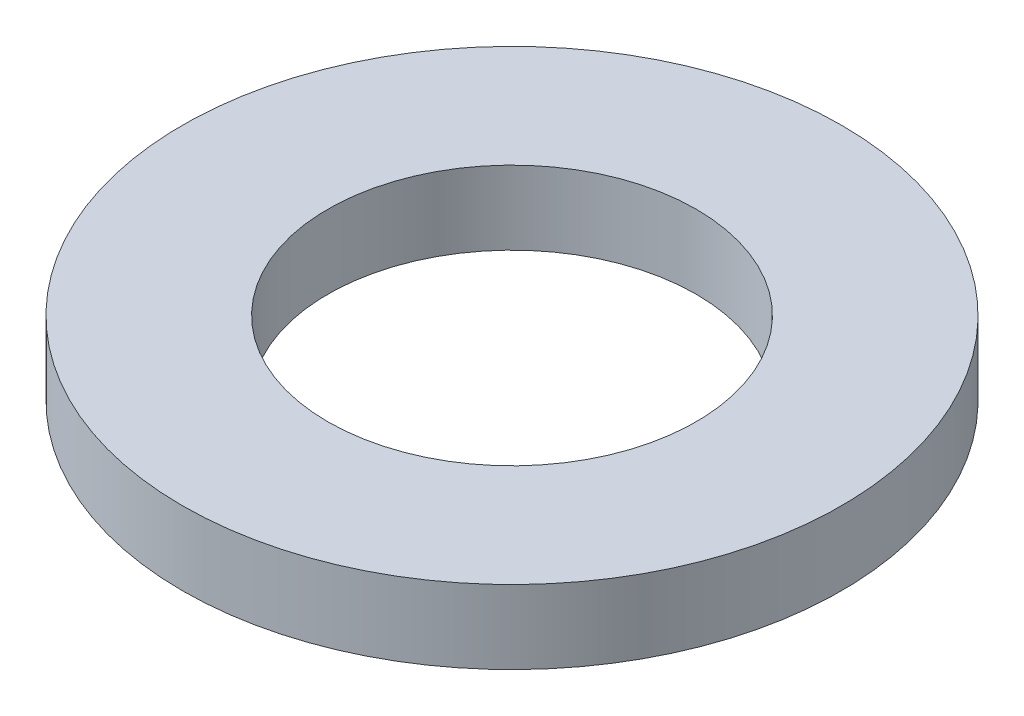
ISO-10303-21;
HEADER;
FILE_DESCRIPTION(('STEP AP214'),'2;1');
FILE_NAME('part.step','',(''),(''),'','','');
FILE_SCHEMA(('AUTOMOTIVE_DESIGN { 1 0 10303 214 1 1 1 1 }'));
ENDSEC;
DATA;
#1=APPLICATION_CONTEXT('core data for automotive mechanical design processes');
#2=APPLICATION_PROTOCOL_DEFINITION('international standard','automotive_design',2000,#1);
#3=PRODUCT_CONTEXT('',#1,'mechanical');
#4=PRODUCT('Part','Part','',(#3));
#5=PRODUCT_RELATED_PRODUCT_CATEGORY('part','',(#4));
#6=PRODUCT_DEFINITION_FORMATION('','',#4);
#7=PRODUCT_DEFINITION_CONTEXT('part definition',#1,'design');
#8=PRODUCT_DEFINITION('design','',#6,#7);
#9=PRODUCT_DEFINITION_SHAPE('','',#8);
#10=(LENGTH_UNIT() NAMED_UNIT(*) SI_UNIT(.MILLI.,.METRE.));
#11=(NAMED_UNIT(*) PLANE_ANGLE_UNIT() SI_UNIT($,.RADIAN.));
#12=(NAMED_UNIT(*) SI_UNIT($,.STERADIAN.) SOLID_ANGLE_UNIT());
#13=UNCERTAINTY_MEASURE_WITH_UNIT(LENGTH_MEASURE(1.E-05),#10,'distance_accuracy_value','');
#14=(GEOMETRIC_REPRESENTATION_CONTEXT(3) GLOBAL_UNCERTAINTY_ASSIGNED_CONTEXT((#13)) GLOBAL_UNIT_ASSIGNED_CONTEXT((#10,
#11,#12)) REPRESENTATION_CONTEXT('',''));
#15=CARTESIAN_POINT('',(0.,0.,0.));
#16=DIRECTION('',(0.,0.,1.));
#17=DIRECTION('',(1.,0.,0.));
#18=AXIS2_PLACEMENT_3D('',#15,#16,#17);
#19=CARTESIAN_POINT('',(0.,19.,0.));
#20=DIRECTION('',(0.,-1.,0.));
#21=DIRECTION('',(0.,0.,-1.));
#22=AXIS2_PLACEMENT_3D('',#19,#20,#21);
#23=CYLINDRICAL_SURFACE('',#22,85.);
#24=CARTESIAN_POINT('',(0.,19.,0.));
#25=DIRECTION('',(0.,1.,0.));
#26=DIRECTION('',(0.,0.,1.));
#27=AXIS2_PLACEMENT_3D('',#24,#25,#26);
#28=CIRCLE('',#27,85.);
#29=CARTESIAN_POINT('',(0.,19.,85.));
#30=VERTEX_POINT('',#29);
#31=EDGE_CURVE('E10',#30,#30,#28,.T.);
#32=ORIENTED_EDGE('',*,*,#31,.F.);
#33=EDGE_LOOP('',(#32));
#34=FACE_BOUND('',#33,.T.);
#35=CARTESIAN_POINT('',(0.,0.,0.));
#36=DIRECTION('',(0.,1.,0.));
#37=DIRECTION('',(0.,0.,1.));
#38=AXIS2_PLACEMENT_3D('',#35,#36,#37);
#39=CIRCLE('',#38,85.);
#40=CARTESIAN_POINT('',(0.,0.,85.));
#41=VERTEX_POINT('',#40);
#42=EDGE_CURVE('E37',#41,#41,#39,.T.);
#43=ORIENTED_EDGE('',*,*,#42,.T.);
#44=EDGE_LOOP('',(#43));
#45=FACE_BOUND('',#44,.T.);
#46=ADVANCED_FACE('F40',(#34,#45),#23,.T.);
#47=CARTESIAN_POINT('',(0.,19.,0.));
#48=DIRECTION('',(0.,1.,0.));
#49=DIRECTION('',(0.,0.,1.));
#50=AXIS2_PLACEMENT_3D('',#47,#48,#49);
#51=PLANE('',#50);
#52=CARTESIAN_POINT('',(0.,19.,0.));
#53=DIRECTION('',(0.,1.,0.));
#54=DIRECTION('',(0.,0.,1.));
#55=AXIS2_PLACEMENT_3D('',#52,#53,#54);
#56=CIRCLE('',#55,47.5);
#57=CARTESIAN_POINT('',(0.,19.,47.5));
#58=VERTEX_POINT('',#57);
#59=EDGE_CURVE('E50',#58,#58,#56,.T.);
#60=ORIENTED_EDGE('',*,*,#59,.F.);
#61=EDGE_LOOP('',(#60));
#62=FACE_BOUND('',#61,.T.);
#63=ORIENTED_EDGE('',*,*,#31,.T.);
#64=EDGE_LOOP('',(#63));
#65=FACE_BOUND('',#64,.T.);
#66=ADVANCED_FACE('F59',(#62,#65),#51,.T.);
#67=CARTESIAN_POINT('',(0.,0.,0.));
#68=DIRECTION('',(0.,1.,0.));
#69=DIRECTION('',(0.,0.,1.));
#70=AXIS2_PLACEMENT_3D('',#67,#68,#69);
#71=PLANE('',#70);
#72=CARTESIAN_POINT('',(0.,0.,0.));
#73=DIRECTION('',(0.,1.,0.));
#74=DIRECTION('',(0.,0.,1.));
#75=AXIS2_PLACEMENT_3D('',#72,#73,#74);
#76=CIRCLE('',#75,47.5);
#77=CARTESIAN_POINT('',(0.,0.,47.5));
#78=VERTEX_POINT('',#77);
#79=EDGE_CURVE('E47',#78,#78,#76,.T.);
#80=ORIENTED_EDGE('',*,*,#79,.T.);
#81=EDGE_LOOP('',(#80));
#82=FACE_BOUND('',#81,.T.);
#83=ORIENTED_EDGE('',*,*,#42,.F.);
#84=EDGE_LOOP('',(#83));
#85=FACE_BOUND('',#84,.T.);
#86=ADVANCED_FACE('F58',(#82,#85),#71,.F.);
#87=CARTESIAN_POINT('',(0.,19.,0.));
#88=DIRECTION('',(0.,-1.,0.));
#89=DIRECTION('',(0.,0.,-1.));
#90=AXIS2_PLACEMENT_3D('',#87,#88,#89);
#91=CYLINDRICAL_SURFACE('',#90,47.5);
#92=ORIENTED_EDGE('',*,*,#59,.T.);
#93=EDGE_LOOP('',(#92));
#94=FACE_BOUND('',#93,.T.);
#95=ORIENTED_EDGE('',*,*,#79,.F.);
#96=EDGE_LOOP('',(#95));
#97=FACE_BOUND('',#96,.T.);
#98=ADVANCED_FACE('F54',(#94,#97),#91,.F.);
#99=CLOSED_SHELL('',(#46,#66,#86,#98));
#100=MANIFOLD_SOLID_BREP('B2',#99);
#101=ADVANCED_BREP_SHAPE_REPRESENTATION('',(#18,#100),#14);
#102=SHAPE_DEFINITION_REPRESENTATION(#9,#101);
ENDSEC;
END-ISO-10303-21;
